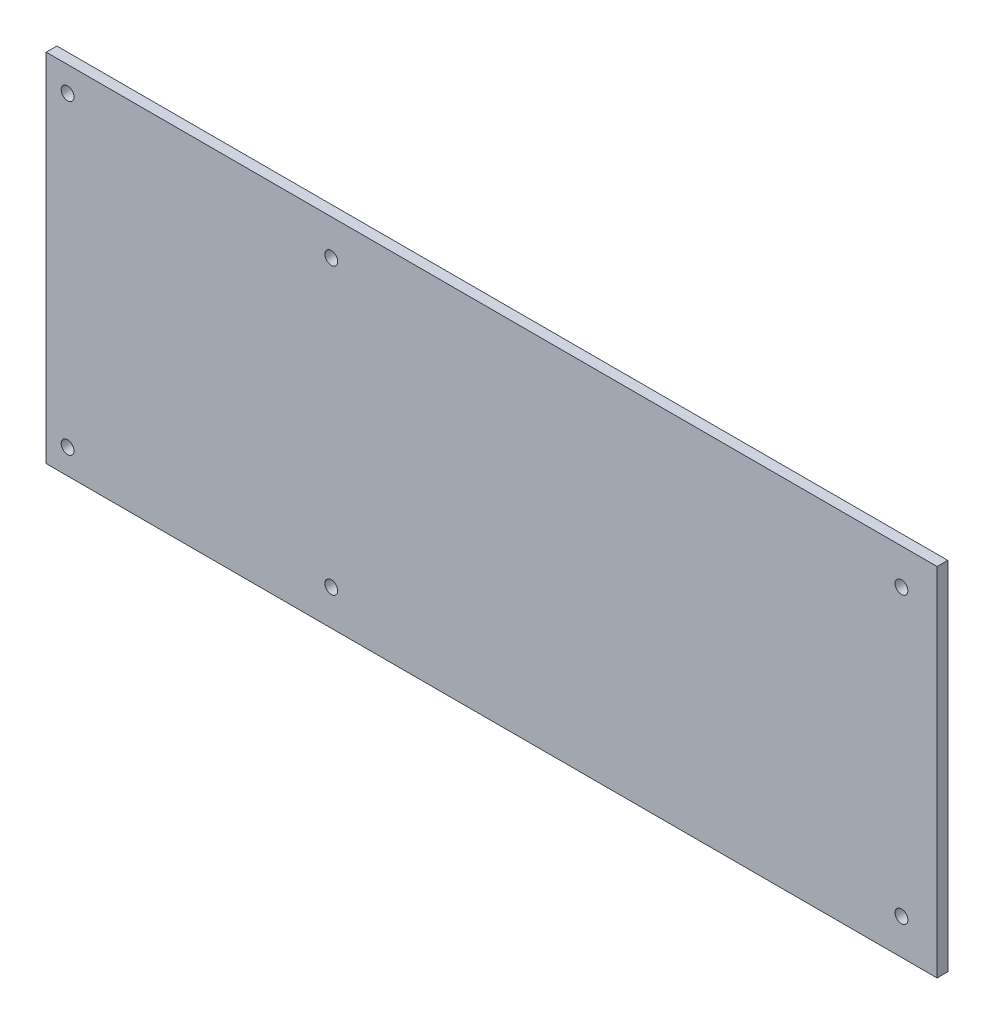
ISO-10303-21;
HEADER;
FILE_DESCRIPTION(('STEP AP214'),'2;1');
FILE_NAME('part.step','',(''),(''),'','','');
FILE_SCHEMA(('AUTOMOTIVE_DESIGN { 1 0 10303 214 1 1 1 1 }'));
ENDSEC;
DATA;
#1=APPLICATION_CONTEXT('core data for automotive mechanical design processes');
#2=APPLICATION_PROTOCOL_DEFINITION('international standard','automotive_design',2000,#1);
#3=PRODUCT_CONTEXT('',#1,'mechanical');
#4=PRODUCT('Part','Part','',(#3));
#5=PRODUCT_RELATED_PRODUCT_CATEGORY('part','',(#4));
#6=PRODUCT_DEFINITION_FORMATION('','',#4);
#7=PRODUCT_DEFINITION_CONTEXT('part definition',#1,'design');
#8=PRODUCT_DEFINITION('design','',#6,#7);
#9=PRODUCT_DEFINITION_SHAPE('','',#8);
#10=(LENGTH_UNIT() NAMED_UNIT(*) SI_UNIT(.MILLI.,.METRE.));
#11=(NAMED_UNIT(*) PLANE_ANGLE_UNIT() SI_UNIT($,.RADIAN.));
#12=(NAMED_UNIT(*) SI_UNIT($,.STERADIAN.) SOLID_ANGLE_UNIT());
#13=UNCERTAINTY_MEASURE_WITH_UNIT(LENGTH_MEASURE(1.E-05),#10,'distance_accuracy_value','');
#14=(GEOMETRIC_REPRESENTATION_CONTEXT(3) GLOBAL_UNCERTAINTY_ASSIGNED_CONTEXT((#13)) GLOBAL_UNIT_ASSIGNED_CONTEXT((#10,
#11,#12)) REPRESENTATION_CONTEXT('',''));
#15=CARTESIAN_POINT('',(0.,0.,0.));
#16=DIRECTION('',(0.,0.,1.));
#17=DIRECTION('',(1.,0.,0.));
#18=AXIS2_PLACEMENT_3D('',#15,#16,#17);
#19=CARTESIAN_POINT('',(0.,0.,3.));
#20=DIRECTION('',(1.,0.,0.));
#21=DIRECTION('',(0.,0.,-1.));
#22=AXIS2_PLACEMENT_3D('',#19,#20,#21);
#23=PLANE('',#22);
#24=DIRECTION('',(0.,-1.,0.));
#25=VECTOR('',#24,1.);
#26=CARTESIAN_POINT('',(0.,0.,0.));
#27=LINE('',#26,#25);
#28=CARTESIAN_POINT('',(0.,100.,0.));
#29=VERTEX_POINT('',#28);
#30=CARTESIAN_POINT('',(0.,0.,0.));
#31=VERTEX_POINT('',#30);
#32=EDGE_CURVE('E95',#29,#31,#27,.T.);
#33=ORIENTED_EDGE('',*,*,#32,.T.);
#34=DIRECTION('',(0.,0.,-1.));
#35=VECTOR('',#34,1.);
#36=CARTESIAN_POINT('',(0.,0.,3.));
#37=LINE('',#36,#35);
#38=CARTESIAN_POINT('',(0.,0.,3.));
#39=VERTEX_POINT('',#38);
#40=EDGE_CURVE('E11',#39,#31,#37,.T.);
#41=ORIENTED_EDGE('',*,*,#40,.F.);
#42=DIRECTION('',(0.,-1.,0.));
#43=VECTOR('',#42,1.);
#44=CARTESIAN_POINT('',(0.,0.,3.));
#45=LINE('',#44,#43);
#46=CARTESIAN_POINT('',(0.,100.,3.));
#47=VERTEX_POINT('',#46);
#48=EDGE_CURVE('E83',#47,#39,#45,.T.);
#49=ORIENTED_EDGE('',*,*,#48,.F.);
#50=DIRECTION('',(0.,0.,-1.));
#51=VECTOR('',#50,1.);
#52=CARTESIAN_POINT('',(0.,100.,3.));
#53=LINE('',#52,#51);
#54=EDGE_CURVE('E91',#47,#29,#53,.T.);
#55=ORIENTED_EDGE('',*,*,#54,.T.);
#56=EDGE_LOOP('',(#33,#41,#49,#55));
#57=FACE_BOUND('',#56,.T.);
#58=ADVANCED_FACE('F32',(#57),#23,.F.);
#59=CARTESIAN_POINT('',(0.,0.,3.));
#60=DIRECTION('',(0.,1.,0.));
#61=DIRECTION('',(0.,0.,1.));
#62=AXIS2_PLACEMENT_3D('',#59,#60,#61);
#63=PLANE('',#62);
#64=DIRECTION('',(1.,0.,0.));
#65=VECTOR('',#64,1.);
#66=CARTESIAN_POINT('',(0.,0.,0.));
#67=LINE('',#66,#65);
#68=CARTESIAN_POINT('',(250.,0.,0.));
#69=VERTEX_POINT('',#68);
#70=EDGE_CURVE('E87',#31,#69,#67,.T.);
#71=ORIENTED_EDGE('',*,*,#70,.T.);
#72=DIRECTION('',(0.,0.,-1.));
#73=VECTOR('',#72,1.);
#74=CARTESIAN_POINT('',(250.,0.,3.));
#75=LINE('',#74,#73);
#76=CARTESIAN_POINT('',(250.,0.,3.));
#77=VERTEX_POINT('',#76);
#78=EDGE_CURVE('E40',#77,#69,#75,.T.);
#79=ORIENTED_EDGE('',*,*,#78,.F.);
#80=DIRECTION('',(1.,0.,0.));
#81=VECTOR('',#80,1.);
#82=CARTESIAN_POINT('',(0.,0.,3.));
#83=LINE('',#82,#81);
#84=EDGE_CURVE('E78',#39,#77,#83,.T.);
#85=ORIENTED_EDGE('',*,*,#84,.F.);
#86=ORIENTED_EDGE('',*,*,#40,.T.);
#87=EDGE_LOOP('',(#71,#79,#85,#86));
#88=FACE_BOUND('',#87,.T.);
#89=ADVANCED_FACE('F86',(#88),#63,.F.);
#90=CARTESIAN_POINT('',(250.,0.,3.));
#91=DIRECTION('',(-1.,0.,0.));
#92=DIRECTION('',(0.,0.,1.));
#93=AXIS2_PLACEMENT_3D('',#90,#91,#92);
#94=PLANE('',#93);
#95=DIRECTION('',(0.,1.,0.));
#96=VECTOR('',#95,1.);
#97=CARTESIAN_POINT('',(250.,0.,0.));
#98=LINE('',#97,#96);
#99=CARTESIAN_POINT('',(250.,100.,0.));
#100=VERTEX_POINT('',#99);
#101=EDGE_CURVE('E65',#69,#100,#98,.T.);
#102=ORIENTED_EDGE('',*,*,#101,.T.);
#103=DIRECTION('',(0.,0.,-1.));
#104=VECTOR('',#103,1.);
#105=CARTESIAN_POINT('',(250.,100.,3.));
#106=LINE('',#105,#104);
#107=CARTESIAN_POINT('',(250.,100.,3.));
#108=VERTEX_POINT('',#107);
#109=EDGE_CURVE('E88',#108,#100,#106,.T.);
#110=ORIENTED_EDGE('',*,*,#109,.F.);
#111=DIRECTION('',(0.,1.,0.));
#112=VECTOR('',#111,1.);
#113=CARTESIAN_POINT('',(250.,0.,3.));
#114=LINE('',#113,#112);
#115=EDGE_CURVE('E81',#77,#108,#114,.T.);
#116=ORIENTED_EDGE('',*,*,#115,.F.);
#117=ORIENTED_EDGE('',*,*,#78,.T.);
#118=EDGE_LOOP('',(#102,#110,#116,#117));
#119=FACE_BOUND('',#118,.T.);
#120=ADVANCED_FACE('F89',(#119),#94,.F.);
#121=CARTESIAN_POINT('',(0.,100.,3.));
#122=DIRECTION('',(0.,-1.,0.));
#123=DIRECTION('',(0.,0.,-1.));
#124=AXIS2_PLACEMENT_3D('',#121,#122,#123);
#125=PLANE('',#124);
#126=DIRECTION('',(-1.,0.,0.));
#127=VECTOR('',#126,1.);
#128=CARTESIAN_POINT('',(0.,100.,0.));
#129=LINE('',#128,#127);
#130=EDGE_CURVE('E71',#100,#29,#129,.T.);
#131=ORIENTED_EDGE('',*,*,#130,.T.);
#132=ORIENTED_EDGE('',*,*,#54,.F.);
#133=DIRECTION('',(-1.,0.,0.));
#134=VECTOR('',#133,1.);
#135=CARTESIAN_POINT('',(0.,100.,3.));
#136=LINE('',#135,#134);
#137=EDGE_CURVE('E48',#108,#47,#136,.T.);
#138=ORIENTED_EDGE('',*,*,#137,.F.);
#139=ORIENTED_EDGE('',*,*,#109,.T.);
#140=EDGE_LOOP('',(#131,#132,#138,#139));
#141=FACE_BOUND('',#140,.T.);
#142=ADVANCED_FACE('F103',(#141),#125,.F.);
#143=CARTESIAN_POINT('',(0.,0.,3.));
#144=DIRECTION('',(0.,0.,-1.));
#145=DIRECTION('',(-1.,0.,0.));
#146=AXIS2_PLACEMENT_3D('',#143,#144,#145);
#147=PLANE('',#146);
#148=CARTESIAN_POINT('',(6.00000000000001,7.,3.));
#149=DIRECTION('',(0.,0.,1.));
#150=DIRECTION('',(1.,0.,0.));
#151=AXIS2_PLACEMENT_3D('',#148,#149,#150);
#152=CIRCLE('',#151,1.8);
#153=CARTESIAN_POINT('',(7.80000000000001,7.,3.));
#154=VERTEX_POINT('',#153);
#155=EDGE_CURVE('E115',#154,#154,#152,.T.);
#156=ORIENTED_EDGE('',*,*,#155,.F.);
#157=EDGE_LOOP('',(#156));
#158=FACE_BOUND('',#157,.T.);
#159=CARTESIAN_POINT('',(80.,10.,3.));
#160=DIRECTION('',(0.,0.,1.));
#161=DIRECTION('',(1.,0.,0.));
#162=AXIS2_PLACEMENT_3D('',#159,#160,#161);
#163=CIRCLE('',#162,1.79999999999999);
#164=CARTESIAN_POINT('',(81.8,10.,3.));
#165=VERTEX_POINT('',#164);
#166=EDGE_CURVE('E121',#165,#165,#163,.T.);
#167=ORIENTED_EDGE('',*,*,#166,.F.);
#168=EDGE_LOOP('',(#167));
#169=FACE_BOUND('',#168,.T.);
#170=CARTESIAN_POINT('',(240.,10.,3.));
#171=DIRECTION('',(0.,0.,1.));
#172=DIRECTION('',(1.,0.,0.));
#173=AXIS2_PLACEMENT_3D('',#170,#171,#172);
#174=CIRCLE('',#173,1.80000000000001);
#175=CARTESIAN_POINT('',(241.8,10.,3.));
#176=VERTEX_POINT('',#175);
#177=EDGE_CURVE('E127',#176,#176,#174,.T.);
#178=ORIENTED_EDGE('',*,*,#177,.F.);
#179=EDGE_LOOP('',(#178));
#180=FACE_BOUND('',#179,.T.);
#181=CARTESIAN_POINT('',(240.,90.,3.));
#182=DIRECTION('',(0.,0.,1.));
#183=DIRECTION('',(1.,0.,0.));
#184=AXIS2_PLACEMENT_3D('',#181,#182,#183);
#185=CIRCLE('',#184,1.80000000000001);
#186=CARTESIAN_POINT('',(241.8,90.,3.));
#187=VERTEX_POINT('',#186);
#188=EDGE_CURVE('E133',#187,#187,#185,.T.);
#189=ORIENTED_EDGE('',*,*,#188,.F.);
#190=EDGE_LOOP('',(#189));
#191=FACE_BOUND('',#190,.T.);
#192=CARTESIAN_POINT('',(80.,90.,3.));
#193=DIRECTION('',(0.,0.,1.));
#194=DIRECTION('',(1.,0.,0.));
#195=AXIS2_PLACEMENT_3D('',#192,#193,#194);
#196=CIRCLE('',#195,1.79999999999999);
#197=CARTESIAN_POINT('',(81.8,90.,3.));
#198=VERTEX_POINT('',#197);
#199=EDGE_CURVE('E139',#198,#198,#196,.T.);
#200=ORIENTED_EDGE('',*,*,#199,.F.);
#201=EDGE_LOOP('',(#200));
#202=FACE_BOUND('',#201,.T.);
#203=CARTESIAN_POINT('',(6.00000000000001,93.,3.));
#204=DIRECTION('',(0.,0.,1.));
#205=DIRECTION('',(1.,0.,0.));
#206=AXIS2_PLACEMENT_3D('',#203,#204,#205);
#207=CIRCLE('',#206,1.8);
#208=CARTESIAN_POINT('',(7.8,93.,3.));
#209=VERTEX_POINT('',#208);
#210=EDGE_CURVE('E109',#209,#209,#207,.T.);
#211=ORIENTED_EDGE('',*,*,#210,.F.);
#212=EDGE_LOOP('',(#211));
#213=FACE_BOUND('',#212,.T.);
#214=ORIENTED_EDGE('',*,*,#48,.T.);
#215=ORIENTED_EDGE('',*,*,#84,.T.);
#216=ORIENTED_EDGE('',*,*,#115,.T.);
#217=ORIENTED_EDGE('',*,*,#137,.T.);
#218=EDGE_LOOP('',(#214,#215,#216,#217));
#219=FACE_BOUND('',#218,.T.);
#220=ADVANCED_FACE('F79',(#158,#169,#180,#191,#202,#213,#219),#147,.F.);
#221=CARTESIAN_POINT('',(0.,0.,0.));
#222=DIRECTION('',(0.,0.,-1.));
#223=DIRECTION('',(-1.,0.,0.));
#224=AXIS2_PLACEMENT_3D('',#221,#222,#223);
#225=PLANE('',#224);
#226=CARTESIAN_POINT('',(6.00000000000001,7.,0.));
#227=DIRECTION('',(0.,0.,1.));
#228=DIRECTION('',(1.,0.,0.));
#229=AXIS2_PLACEMENT_3D('',#226,#227,#228);
#230=CIRCLE('',#229,1.8);
#231=CARTESIAN_POINT('',(7.80000000000001,7.,0.));
#232=VERTEX_POINT('',#231);
#233=EDGE_CURVE('E118',#232,#232,#230,.T.);
#234=ORIENTED_EDGE('',*,*,#233,.T.);
#235=EDGE_LOOP('',(#234));
#236=FACE_BOUND('',#235,.T.);
#237=CARTESIAN_POINT('',(80.,10.,0.));
#238=DIRECTION('',(0.,0.,1.));
#239=DIRECTION('',(1.,0.,0.));
#240=AXIS2_PLACEMENT_3D('',#237,#238,#239);
#241=CIRCLE('',#240,1.79999999999999);
#242=CARTESIAN_POINT('',(81.8,10.,0.));
#243=VERTEX_POINT('',#242);
#244=EDGE_CURVE('E124',#243,#243,#241,.T.);
#245=ORIENTED_EDGE('',*,*,#244,.T.);
#246=EDGE_LOOP('',(#245));
#247=FACE_BOUND('',#246,.T.);
#248=CARTESIAN_POINT('',(240.,10.,0.));
#249=DIRECTION('',(0.,0.,1.));
#250=DIRECTION('',(1.,0.,0.));
#251=AXIS2_PLACEMENT_3D('',#248,#249,#250);
#252=CIRCLE('',#251,1.80000000000001);
#253=CARTESIAN_POINT('',(241.8,10.,0.));
#254=VERTEX_POINT('',#253);
#255=EDGE_CURVE('E130',#254,#254,#252,.T.);
#256=ORIENTED_EDGE('',*,*,#255,.T.);
#257=EDGE_LOOP('',(#256));
#258=FACE_BOUND('',#257,.T.);
#259=CARTESIAN_POINT('',(240.,90.,0.));
#260=DIRECTION('',(0.,0.,1.));
#261=DIRECTION('',(1.,0.,0.));
#262=AXIS2_PLACEMENT_3D('',#259,#260,#261);
#263=CIRCLE('',#262,1.80000000000001);
#264=CARTESIAN_POINT('',(241.8,90.,0.));
#265=VERTEX_POINT('',#264);
#266=EDGE_CURVE('E136',#265,#265,#263,.T.);
#267=ORIENTED_EDGE('',*,*,#266,.T.);
#268=EDGE_LOOP('',(#267));
#269=FACE_BOUND('',#268,.T.);
#270=CARTESIAN_POINT('',(80.,90.,0.));
#271=DIRECTION('',(0.,0.,1.));
#272=DIRECTION('',(1.,0.,0.));
#273=AXIS2_PLACEMENT_3D('',#270,#271,#272);
#274=CIRCLE('',#273,1.79999999999999);
#275=CARTESIAN_POINT('',(81.8,90.,0.));
#276=VERTEX_POINT('',#275);
#277=EDGE_CURVE('E112',#276,#276,#274,.T.);
#278=ORIENTED_EDGE('',*,*,#277,.T.);
#279=EDGE_LOOP('',(#278));
#280=FACE_BOUND('',#279,.T.);
#281=CARTESIAN_POINT('',(6.00000000000001,93.,0.));
#282=DIRECTION('',(0.,0.,1.));
#283=DIRECTION('',(1.,0.,0.));
#284=AXIS2_PLACEMENT_3D('',#281,#282,#283);
#285=CIRCLE('',#284,1.8);
#286=CARTESIAN_POINT('',(7.8,93.,0.));
#287=VERTEX_POINT('',#286);
#288=EDGE_CURVE('E98',#287,#287,#285,.T.);
#289=ORIENTED_EDGE('',*,*,#288,.T.);
#290=EDGE_LOOP('',(#289));
#291=FACE_BOUND('',#290,.T.);
#292=ORIENTED_EDGE('',*,*,#32,.F.);
#293=ORIENTED_EDGE('',*,*,#130,.F.);
#294=ORIENTED_EDGE('',*,*,#101,.F.);
#295=ORIENTED_EDGE('',*,*,#70,.F.);
#296=EDGE_LOOP('',(#292,#293,#294,#295));
#297=FACE_BOUND('',#296,.T.);
#298=ADVANCED_FACE('F106',(#236,#247,#258,#269,#280,#291,#297),#225,.T.);
#299=CARTESIAN_POINT('',(6.00000000000001,93.,0.));
#300=DIRECTION('',(0.,0.,1.));
#301=DIRECTION('',(1.,0.,0.));
#302=AXIS2_PLACEMENT_3D('',#299,#300,#301);
#303=CYLINDRICAL_SURFACE('',#302,1.8);
#304=ORIENTED_EDGE('',*,*,#288,.F.);
#305=EDGE_LOOP('',(#304));
#306=FACE_BOUND('',#305,.T.);
#307=ORIENTED_EDGE('',*,*,#210,.T.);
#308=EDGE_LOOP('',(#307));
#309=FACE_BOUND('',#308,.T.);
#310=ADVANCED_FACE('F151',(#306,#309),#303,.F.);
#311=CARTESIAN_POINT('',(80.,90.,0.));
#312=DIRECTION('',(0.,0.,1.));
#313=DIRECTION('',(1.,0.,0.));
#314=AXIS2_PLACEMENT_3D('',#311,#312,#313);
#315=CYLINDRICAL_SURFACE('',#314,1.79999999999999);
#316=ORIENTED_EDGE('',*,*,#277,.F.);
#317=EDGE_LOOP('',(#316));
#318=FACE_BOUND('',#317,.T.);
#319=ORIENTED_EDGE('',*,*,#199,.T.);
#320=EDGE_LOOP('',(#319));
#321=FACE_BOUND('',#320,.T.);
#322=ADVANCED_FACE('F147',(#318,#321),#315,.F.);
#323=CARTESIAN_POINT('',(240.,90.,0.));
#324=DIRECTION('',(0.,0.,1.));
#325=DIRECTION('',(1.,0.,0.));
#326=AXIS2_PLACEMENT_3D('',#323,#324,#325);
#327=CYLINDRICAL_SURFACE('',#326,1.80000000000001);
#328=ORIENTED_EDGE('',*,*,#266,.F.);
#329=EDGE_LOOP('',(#328));
#330=FACE_BOUND('',#329,.T.);
#331=ORIENTED_EDGE('',*,*,#188,.T.);
#332=EDGE_LOOP('',(#331));
#333=FACE_BOUND('',#332,.T.);
#334=ADVANCED_FACE('F150',(#330,#333),#327,.F.);
#335=CARTESIAN_POINT('',(240.,10.,0.));
#336=DIRECTION('',(0.,0.,1.));
#337=DIRECTION('',(1.,0.,0.));
#338=AXIS2_PLACEMENT_3D('',#335,#336,#337);
#339=CYLINDRICAL_SURFACE('',#338,1.80000000000001);
#340=ORIENTED_EDGE('',*,*,#255,.F.);
#341=EDGE_LOOP('',(#340));
#342=FACE_BOUND('',#341,.T.);
#343=ORIENTED_EDGE('',*,*,#177,.T.);
#344=EDGE_LOOP('',(#343));
#345=FACE_BOUND('',#344,.T.);
#346=ADVANCED_FACE('F212',(#342,#345),#339,.F.);
#347=CARTESIAN_POINT('',(80.,10.,0.));
#348=DIRECTION('',(0.,0.,1.));
#349=DIRECTION('',(1.,0.,0.));
#350=AXIS2_PLACEMENT_3D('',#347,#348,#349);
#351=CYLINDRICAL_SURFACE('',#350,1.79999999999999);
#352=ORIENTED_EDGE('',*,*,#244,.F.);
#353=EDGE_LOOP('',(#352));
#354=FACE_BOUND('',#353,.T.);
#355=ORIENTED_EDGE('',*,*,#166,.T.);
#356=EDGE_LOOP('',(#355));
#357=FACE_BOUND('',#356,.T.);
#358=ADVANCED_FACE('F222',(#354,#357),#351,.F.);
#359=CARTESIAN_POINT('',(6.00000000000001,7.,0.));
#360=DIRECTION('',(0.,0.,1.));
#361=DIRECTION('',(1.,0.,0.));
#362=AXIS2_PLACEMENT_3D('',#359,#360,#361);
#363=CYLINDRICAL_SURFACE('',#362,1.8);
#364=ORIENTED_EDGE('',*,*,#233,.F.);
#365=EDGE_LOOP('',(#364));
#366=FACE_BOUND('',#365,.T.);
#367=ORIENTED_EDGE('',*,*,#155,.T.);
#368=EDGE_LOOP('',(#367));
#369=FACE_BOUND('',#368,.T.);
#370=ADVANCED_FACE('F232',(#366,#369),#363,.F.);
#371=CLOSED_SHELL('',(#58,#89,#120,#142,#220,#298,#310,#322,#334,#346,#358,#370));
#372=MANIFOLD_SOLID_BREP('B2',#371);
#373=ADVANCED_BREP_SHAPE_REPRESENTATION('',(#18,#372),#14);
#374=SHAPE_DEFINITION_REPRESENTATION(#9,#373);
ENDSEC;
END-ISO-10303-21;
